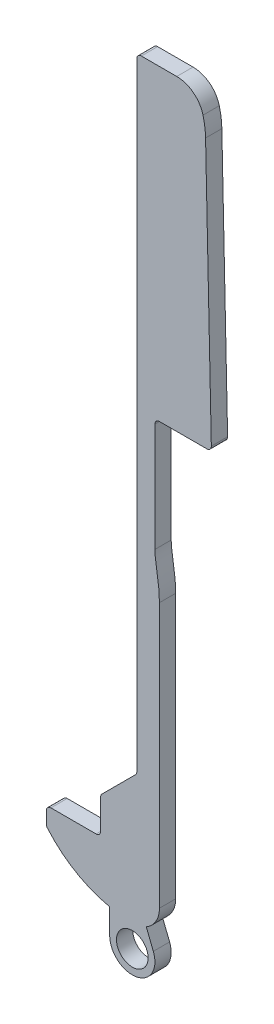
ISO-10303-21;
HEADER;
FILE_DESCRIPTION(('STEP AP214'),'2;1');
FILE_NAME('part.step','',(''),(''),'','','');
FILE_SCHEMA(('AUTOMOTIVE_DESIGN { 1 0 10303 214 1 1 1 1 }'));
ENDSEC;
DATA;
#1=APPLICATION_CONTEXT('core data for automotive mechanical design processes');
#2=APPLICATION_PROTOCOL_DEFINITION('international standard','automotive_design',2000,#1);
#3=PRODUCT_CONTEXT('',#1,'mechanical');
#4=PRODUCT('Part','Part','',(#3));
#5=PRODUCT_RELATED_PRODUCT_CATEGORY('part','',(#4));
#6=PRODUCT_DEFINITION_FORMATION('','',#4);
#7=PRODUCT_DEFINITION_CONTEXT('part definition',#1,'design');
#8=PRODUCT_DEFINITION('design','',#6,#7);
#9=PRODUCT_DEFINITION_SHAPE('','',#8);
#10=(LENGTH_UNIT() NAMED_UNIT(*) SI_UNIT(.MILLI.,.METRE.));
#11=(NAMED_UNIT(*) PLANE_ANGLE_UNIT() SI_UNIT($,.RADIAN.));
#12=(NAMED_UNIT(*) SI_UNIT($,.STERADIAN.) SOLID_ANGLE_UNIT());
#13=UNCERTAINTY_MEASURE_WITH_UNIT(LENGTH_MEASURE(1.E-05),#10,'distance_accuracy_value','');
#14=(GEOMETRIC_REPRESENTATION_CONTEXT(3) GLOBAL_UNCERTAINTY_ASSIGNED_CONTEXT((#13)) GLOBAL_UNIT_ASSIGNED_CONTEXT((#10,
#11,#12)) REPRESENTATION_CONTEXT('',''));
#15=CARTESIAN_POINT('',(0.,0.,0.));
#16=DIRECTION('',(0.,0.,1.));
#17=DIRECTION('',(1.,0.,0.));
#18=AXIS2_PLACEMENT_3D('',#15,#16,#17);
#19=CARTESIAN_POINT('',(14.4143233217841,80.5,1.8));
#20=DIRECTION('',(0.,0.,-1.));
#21=DIRECTION('',(-1.,0.,0.));
#22=AXIS2_PLACEMENT_3D('',#19,#20,#21);
#23=CYLINDRICAL_SURFACE('',#22,3.);
#24=DIRECTION('',(0.,0.,-1.));
#25=VECTOR('',#24,1.);
#26=CARTESIAN_POINT('',(17.3194338133368,81.2485539605604,1.8));
#27=LINE('',#26,#25);
#28=CARTESIAN_POINT('',(17.3194338133368,81.2485539605604,0.));
#29=VERTEX_POINT('',#28);
#30=CARTESIAN_POINT('',(17.3194338133368,81.2485539605604,1.8));
#31=VERTEX_POINT('',#30);
#32=EDGE_CURVE('E320',#29,#31,#27,.F.);
#33=ORIENTED_EDGE('',*,*,#32,.F.);
#34=CARTESIAN_POINT('',(14.4143233217841,80.5,0.));
#35=DIRECTION('',(0.,0.,-1.));
#36=DIRECTION('',(-1.,0.,0.));
#37=AXIS2_PLACEMENT_3D('',#34,#35,#36);
#38=CIRCLE('',#37,3.);
#39=CARTESIAN_POINT('',(14.4143233217841,83.5,0.));
#40=VERTEX_POINT('',#39);
#41=EDGE_CURVE('E45',#40,#29,#38,.T.);
#42=ORIENTED_EDGE('',*,*,#41,.F.);
#43=DIRECTION('',(0.,0.,-1.));
#44=VECTOR('',#43,1.);
#45=CARTESIAN_POINT('',(14.4143233217841,83.5,1.8));
#46=LINE('',#45,#44);
#47=CARTESIAN_POINT('',(14.4143233217841,83.5,1.8));
#48=VERTEX_POINT('',#47);
#49=EDGE_CURVE('E324',#48,#40,#46,.T.);
#50=ORIENTED_EDGE('',*,*,#49,.F.);
#51=CARTESIAN_POINT('',(14.4143233217841,80.5,1.8));
#52=DIRECTION('',(0.,0.,-1.));
#53=DIRECTION('',(-1.,0.,0.));
#54=AXIS2_PLACEMENT_3D('',#51,#52,#53);
#55=CIRCLE('',#54,3.);
#56=EDGE_CURVE('E11',#31,#48,#55,.F.);
#57=ORIENTED_EDGE('',*,*,#56,.F.);
#58=EDGE_LOOP('',(#33,#42,#50,#57));
#59=FACE_BOUND('',#58,.T.);
#60=ADVANCED_FACE('F38',(#59),#23,.T.);
#61=CARTESIAN_POINT('',(9.61,12.5113444444444,1.8));
#62=DIRECTION('',(0.,0.,-1.));
#63=DIRECTION('',(-1.,0.,0.));
#64=AXIS2_PLACEMENT_3D('',#61,#62,#63);
#65=CYLINDRICAL_SURFACE('',#64,12.5113444444444);
#66=DIRECTION('',(0.,0.,-1.));
#67=VECTOR('',#66,1.);
#68=CARTESIAN_POINT('',(7.,0.275265014842374,1.8));
#69=LINE('',#68,#67);
#70=CARTESIAN_POINT('',(7.,0.275265014842374,1.8));
#71=VERTEX_POINT('',#70);
#72=CARTESIAN_POINT('',(7.,0.275265014842374,0.));
#73=VERTEX_POINT('',#72);
#74=EDGE_CURVE('E232',#71,#73,#69,.T.);
#75=ORIENTED_EDGE('',*,*,#74,.F.);
#76=CARTESIAN_POINT('',(9.61,12.5113444444444,1.8));
#77=DIRECTION('',(0.,0.,1.));
#78=DIRECTION('',(-1.,0.,0.));
#79=AXIS2_PLACEMENT_3D('',#76,#77,#78);
#80=CIRCLE('',#79,12.5113444444444);
#81=CARTESIAN_POINT('',(0.120775174580328,4.35730544403674,1.8));
#82=VERTEX_POINT('',#81);
#83=EDGE_CURVE('E242',#82,#71,#80,.T.);
#84=ORIENTED_EDGE('',*,*,#83,.F.);
#85=DIRECTION('',(0.,0.,-1.));
#86=VECTOR('',#85,1.);
#87=CARTESIAN_POINT('',(0.120775174580328,4.35730544403674,1.8));
#88=LINE('',#87,#86);
#89=CARTESIAN_POINT('',(0.120775174580328,4.35730544403674,0.));
#90=VERTEX_POINT('',#89);
#91=EDGE_CURVE('E397',#82,#90,#88,.T.);
#92=ORIENTED_EDGE('',*,*,#91,.T.);
#93=CARTESIAN_POINT('',(9.61,12.5113444444444,0.));
#94=DIRECTION('',(0.,0.,1.));
#95=DIRECTION('',(-1.,0.,0.));
#96=AXIS2_PLACEMENT_3D('',#93,#94,#95);
#97=CIRCLE('',#96,12.5113444444444);
#98=EDGE_CURVE('E241',#90,#73,#97,.T.);
#99=ORIENTED_EDGE('',*,*,#98,.T.);
#100=EDGE_LOOP('',(#75,#84,#92,#99));
#101=FACE_BOUND('',#100,.T.);
#102=ADVANCED_FACE('F274',(#101),#65,.T.);
#103=CARTESIAN_POINT('',(9.61,2.89,1.8));
#104=DIRECTION('',(0.,0.,-1.));
#105=DIRECTION('',(-1.,0.,0.));
#106=AXIS2_PLACEMENT_3D('',#103,#104,#105);
#107=CYLINDRICAL_SURFACE('',#106,2.89000000000001);
#108=DIRECTION('',(0.,0.,-1.));
#109=VECTOR('',#108,1.);
#110=CARTESIAN_POINT('',(11.0467605424043,0.382447579054421,1.8));
#111=LINE('',#110,#109);
#112=CARTESIAN_POINT('',(11.0467605424043,0.382447579054422,0.));
#113=VERTEX_POINT('',#112);
#114=CARTESIAN_POINT('',(11.0467605424043,0.382447579054422,1.8));
#115=VERTEX_POINT('',#114);
#116=EDGE_CURVE('E215',#113,#115,#111,.F.);
#117=ORIENTED_EDGE('',*,*,#116,.F.);
#118=CARTESIAN_POINT('',(9.61,2.89,0.));
#119=DIRECTION('',(0.,0.,1.));
#120=DIRECTION('',(-1.,0.,0.));
#121=AXIS2_PLACEMENT_3D('',#118,#119,#120);
#122=CIRCLE('',#121,2.89000000000001);
#123=CARTESIAN_POINT('',(12.5,2.89,0.));
#124=VERTEX_POINT('',#123);
#125=EDGE_CURVE('E471',#113,#124,#122,.T.);
#126=ORIENTED_EDGE('',*,*,#125,.T.);
#127=DIRECTION('',(0.,0.,-1.));
#128=VECTOR('',#127,1.);
#129=CARTESIAN_POINT('',(12.5,2.89,1.8));
#130=LINE('',#129,#128);
#131=CARTESIAN_POINT('',(12.5,2.89,1.8));
#132=VERTEX_POINT('',#131);
#133=EDGE_CURVE('E365',#132,#124,#130,.T.);
#134=ORIENTED_EDGE('',*,*,#133,.F.);
#135=CARTESIAN_POINT('',(9.61,2.89,1.8));
#136=DIRECTION('',(0.,0.,1.));
#137=DIRECTION('',(-1.,0.,0.));
#138=AXIS2_PLACEMENT_3D('',#135,#136,#137);
#139=CIRCLE('',#138,2.89000000000001);
#140=EDGE_CURVE('E244',#115,#132,#139,.T.);
#141=ORIENTED_EDGE('',*,*,#140,.F.);
#142=EDGE_LOOP('',(#117,#126,#134,#141));
#143=FACE_BOUND('',#142,.T.);
#144=ADVANCED_FACE('F270',(#143),#107,.T.);
#145=CARTESIAN_POINT('',(12.5,32.15,1.8));
#146=DIRECTION('',(-1.,0.,0.));
#147=DIRECTION('',(0.,-1.,0.));
#148=AXIS2_PLACEMENT_3D('',#145,#146,#147);
#149=PLANE('',#148);
#150=DIRECTION('',(0.,1.,0.));
#151=VECTOR('',#150,1.);
#152=CARTESIAN_POINT('',(12.5,32.15,0.));
#153=LINE('',#152,#151);
#154=CARTESIAN_POINT('',(12.5,32.15,0.));
#155=VERTEX_POINT('',#154);
#156=EDGE_CURVE('E473',#124,#155,#153,.T.);
#157=ORIENTED_EDGE('',*,*,#156,.T.);
#158=DIRECTION('',(0.,0.,-1.));
#159=VECTOR('',#158,1.);
#160=CARTESIAN_POINT('',(12.5,32.15,1.8));
#161=LINE('',#160,#159);
#162=CARTESIAN_POINT('',(12.5,32.15,1.8));
#163=VERTEX_POINT('',#162);
#164=EDGE_CURVE('E362',#163,#155,#161,.T.);
#165=ORIENTED_EDGE('',*,*,#164,.F.);
#166=DIRECTION('',(0.,1.,0.));
#167=VECTOR('',#166,1.);
#168=CARTESIAN_POINT('',(12.5,32.15,1.8));
#169=LINE('',#168,#167);
#170=EDGE_CURVE('E247',#132,#163,#169,.T.);
#171=ORIENTED_EDGE('',*,*,#170,.F.);
#172=ORIENTED_EDGE('',*,*,#133,.T.);
#173=EDGE_LOOP('',(#157,#165,#171,#172));
#174=FACE_BOUND('',#173,.T.);
#175=ADVANCED_FACE('F265',(#174),#149,.F.);
#176=CARTESIAN_POINT('',(12.5,32.15,1.8));
#177=CARTESIAN_POINT('',(12.5,34.1534508074309,1.8));
#178=CARTESIAN_POINT('',(12.,35.7421929324208,1.8));
#179=CARTESIAN_POINT('',(12.,37.,1.8));
#180=B_SPLINE_CURVE_WITH_KNOTS('',3,(#176,#177,#178,#179),.UNSPECIFIED.,.F.,.F.,(4,4),(0.,1.),.UNSPECIFIED.);
#181=DIRECTION('',(0.,0.,-1.));
#182=VECTOR('',#181,1.);
#183=SURFACE_OF_LINEAR_EXTRUSION('',#180,#182);
#184=CARTESIAN_POINT('',(12.5,32.15,0.));
#185=CARTESIAN_POINT('',(12.5,34.1534508074309,0.));
#186=CARTESIAN_POINT('',(12.,35.7421929324208,0.));
#187=CARTESIAN_POINT('',(12.,37.,0.));
#188=B_SPLINE_CURVE_WITH_KNOTS('',3,(#184,#185,#186,#187),.UNSPECIFIED.,.F.,.F.,(4,4),(0.,1.),.UNSPECIFIED.);
#189=CARTESIAN_POINT('',(12.,37.,0.));
#190=VERTEX_POINT('',#189);
#191=EDGE_CURVE('E475',#155,#190,#188,.T.);
#192=ORIENTED_EDGE('',*,*,#191,.T.);
#193=DIRECTION('',(0.,0.,-1.));
#194=VECTOR('',#193,1.);
#195=CARTESIAN_POINT('',(12.,37.,1.8));
#196=LINE('',#195,#194);
#197=CARTESIAN_POINT('',(12.,37.,1.8));
#198=VERTEX_POINT('',#197);
#199=EDGE_CURVE('E358',#198,#190,#196,.T.);
#200=ORIENTED_EDGE('',*,*,#199,.F.);
#201=EDGE_CURVE('E249',#163,#198,#180,.T.);
#202=ORIENTED_EDGE('',*,*,#201,.F.);
#203=ORIENTED_EDGE('',*,*,#164,.T.);
#204=EDGE_LOOP('',(#192,#200,#202,#203));
#205=FACE_BOUND('',#204,.T.);
#206=ADVANCED_FACE('F260',(#205),#183,.F.);
#207=CARTESIAN_POINT('',(12.,49.5,1.8));
#208=DIRECTION('',(-1.,0.,0.));
#209=DIRECTION('',(0.,-1.,0.));
#210=AXIS2_PLACEMENT_3D('',#207,#208,#209);
#211=PLANE('',#210);
#212=DIRECTION('',(0.,1.,0.));
#213=VECTOR('',#212,1.);
#214=CARTESIAN_POINT('',(12.,49.5,0.));
#215=LINE('',#214,#213);
#216=CARTESIAN_POINT('',(12.,49.,0.));
#217=VERTEX_POINT('',#216);
#218=EDGE_CURVE('E479',#190,#217,#215,.T.);
#219=ORIENTED_EDGE('',*,*,#218,.T.);
#220=DIRECTION('',(0.,0.,-1.));
#221=VECTOR('',#220,1.);
#222=CARTESIAN_POINT('',(12.,49.,1.8));
#223=LINE('',#222,#221);
#224=CARTESIAN_POINT('',(12.,49.,1.8));
#225=VERTEX_POINT('',#224);
#226=EDGE_CURVE('E425',#217,#225,#223,.F.);
#227=ORIENTED_EDGE('',*,*,#226,.T.);
#228=DIRECTION('',(0.,1.,0.));
#229=VECTOR('',#228,1.);
#230=CARTESIAN_POINT('',(12.,49.5,1.8));
#231=LINE('',#230,#229);
#232=EDGE_CURVE('E254',#198,#225,#231,.T.);
#233=ORIENTED_EDGE('',*,*,#232,.F.);
#234=ORIENTED_EDGE('',*,*,#199,.T.);
#235=EDGE_LOOP('',(#219,#227,#233,#234));
#236=FACE_BOUND('',#235,.T.);
#237=ADVANCED_FACE('F264',(#236),#211,.F.);
#238=CARTESIAN_POINT('',(18.25,49.5,1.8));
#239=DIRECTION('',(0.,1.,0.));
#240=DIRECTION('',(0.,0.,1.));
#241=AXIS2_PLACEMENT_3D('',#238,#239,#240);
#242=PLANE('',#241);
#243=DIRECTION('',(1.,0.,0.));
#244=VECTOR('',#243,1.);
#245=CARTESIAN_POINT('',(18.25,49.5,1.8));
#246=LINE('',#245,#244);
#247=CARTESIAN_POINT('',(12.5,49.5,1.8));
#248=VERTEX_POINT('',#247);
#249=CARTESIAN_POINT('',(17.7389709464066,49.5,1.8));
#250=VERTEX_POINT('',#249);
#251=EDGE_CURVE('E494',#248,#250,#246,.T.);
#252=ORIENTED_EDGE('',*,*,#251,.F.);
#253=DIRECTION('',(0.,0.,-1.));
#254=VECTOR('',#253,1.);
#255=CARTESIAN_POINT('',(12.5,49.5,0.));
#256=LINE('',#255,#254);
#257=CARTESIAN_POINT('',(12.5,49.5,0.));
#258=VERTEX_POINT('',#257);
#259=EDGE_CURVE('E422',#248,#258,#256,.T.);
#260=ORIENTED_EDGE('',*,*,#259,.T.);
#261=DIRECTION('',(1.,0.,0.));
#262=VECTOR('',#261,1.);
#263=CARTESIAN_POINT('',(18.25,49.5,0.));
#264=LINE('',#263,#262);
#265=CARTESIAN_POINT('',(17.7389709464066,49.5,0.));
#266=VERTEX_POINT('',#265);
#267=EDGE_CURVE('E340',#258,#266,#264,.T.);
#268=ORIENTED_EDGE('',*,*,#267,.T.);
#269=DIRECTION('',(0.,0.,-1.));
#270=VECTOR('',#269,1.);
#271=CARTESIAN_POINT('',(17.7389709464066,49.5,1.8));
#272=LINE('',#271,#270);
#273=EDGE_CURVE('E420',#266,#250,#272,.F.);
#274=ORIENTED_EDGE('',*,*,#273,.T.);
#275=EDGE_LOOP('',(#252,#260,#268,#274));
#276=FACE_BOUND('',#275,.T.);
#277=ADVANCED_FACE('F489',(#276),#242,.F.);
#278=CARTESIAN_POINT('',(18.25,49.5,1.8));
#279=DIRECTION('',(-0.999762027079909,-0.0218148850345616,0.));
#280=DIRECTION('',(0.0218148850345616,-0.999762027079909,0.));
#281=AXIS2_PLACEMENT_3D('',#278,#279,#280);
#282=PLANE('',#281);
#283=DIRECTION('',(-0.0218148850345616,0.999762027079909,0.));
#284=VECTOR('',#283,1.);
#285=CARTESIAN_POINT('',(18.25,49.5,1.8));
#286=LINE('',#285,#284);
#287=CARTESIAN_POINT('',(18.2388519599465,50.0109074425173,1.8));
#288=VERTEX_POINT('',#287);
#289=CARTESIAN_POINT('',(17.601960582398,79.1992260441903,1.8));
#290=VERTEX_POINT('',#289);
#291=EDGE_CURVE('E456',#288,#290,#286,.T.);
#292=ORIENTED_EDGE('',*,*,#291,.F.);
#293=DIRECTION('',(0.,0.,-1.));
#294=VECTOR('',#293,1.);
#295=CARTESIAN_POINT('',(18.2388519599465,50.0109074425173,1.8));
#296=LINE('',#295,#294);
#297=CARTESIAN_POINT('',(18.2388519599465,50.0109074425173,0.));
#298=VERTEX_POINT('',#297);
#299=EDGE_CURVE('E427',#288,#298,#296,.T.);
#300=ORIENTED_EDGE('',*,*,#299,.T.);
#301=DIRECTION('',(-0.0218148850345616,0.999762027079909,0.));
#302=VECTOR('',#301,1.);
#303=CARTESIAN_POINT('',(18.25,49.5,0.));
#304=LINE('',#303,#302);
#305=CARTESIAN_POINT('',(17.601960582398,79.1992260441903,0.));
#306=VERTEX_POINT('',#305);
#307=EDGE_CURVE('E336',#298,#306,#304,.T.);
#308=ORIENTED_EDGE('',*,*,#307,.T.);
#309=DIRECTION('',(0.,0.,-1.));
#310=VECTOR('',#309,1.);
#311=CARTESIAN_POINT('',(17.601960582398,79.1992260441903,1.8));
#312=LINE('',#311,#310);
#313=EDGE_CURVE('E332',#290,#306,#312,.T.);
#314=ORIENTED_EDGE('',*,*,#313,.F.);
#315=EDGE_LOOP('',(#292,#300,#308,#314));
#316=FACE_BOUND('',#315,.T.);
#317=ADVANCED_FACE('F496',(#316),#282,.F.);
#318=CARTESIAN_POINT('',(8.60410233867879,79.0028920788793,1.8));
#319=DIRECTION('',(0.,0.,-1.));
#320=DIRECTION('',(-1.,0.,0.));
#321=AXIS2_PLACEMENT_3D('',#318,#319,#320);
#322=CYLINDRICAL_SURFACE('',#321,9.00000000000001);
#323=CARTESIAN_POINT('',(8.60410233867879,79.0028920788793,0.));
#324=DIRECTION('',(0.,0.,1.));
#325=DIRECTION('',(1.,0.,0.));
#326=AXIS2_PLACEMENT_3D('',#323,#324,#325);
#327=CIRCLE('',#326,9.00000000000001);
#328=EDGE_CURVE('E329',#306,#29,#327,.T.);
#329=ORIENTED_EDGE('',*,*,#328,.T.);
#330=ORIENTED_EDGE('',*,*,#32,.T.);
#331=CARTESIAN_POINT('',(8.60410233867879,79.0028920788793,1.8));
#332=DIRECTION('',(0.,0.,1.));
#333=DIRECTION('',(1.,0.,0.));
#334=AXIS2_PLACEMENT_3D('',#331,#332,#333);
#335=CIRCLE('',#334,9.00000000000001);
#336=EDGE_CURVE('E451',#290,#31,#335,.T.);
#337=ORIENTED_EDGE('',*,*,#336,.F.);
#338=ORIENTED_EDGE('',*,*,#313,.T.);
#339=EDGE_LOOP('',(#329,#330,#337,#338));
#340=FACE_BOUND('',#339,.T.);
#341=ADVANCED_FACE('F330',(#340),#322,.T.);
#342=CARTESIAN_POINT('',(10.,83.5,1.8));
#343=DIRECTION('',(0.,-1.,0.));
#344=DIRECTION('',(0.,0.,-1.));
#345=AXIS2_PLACEMENT_3D('',#342,#343,#344);
#346=PLANE('',#345);
#347=DIRECTION('',(-1.,0.,0.));
#348=VECTOR('',#347,1.);
#349=CARTESIAN_POINT('',(10.,83.5,1.8));
#350=LINE('',#349,#348);
#351=CARTESIAN_POINT('',(10.5,83.5,1.8));
#352=VERTEX_POINT('',#351);
#353=EDGE_CURVE('E449',#48,#352,#350,.T.);
#354=ORIENTED_EDGE('',*,*,#353,.F.);
#355=ORIENTED_EDGE('',*,*,#49,.T.);
#356=DIRECTION('',(-1.,0.,0.));
#357=VECTOR('',#356,1.);
#358=CARTESIAN_POINT('',(10.,83.5,0.));
#359=LINE('',#358,#357);
#360=CARTESIAN_POINT('',(10.5,83.5,0.));
#361=VERTEX_POINT('',#360);
#362=EDGE_CURVE('E335',#40,#361,#359,.T.);
#363=ORIENTED_EDGE('',*,*,#362,.T.);
#364=DIRECTION('',(0.,0.,-1.));
#365=VECTOR('',#364,1.);
#366=CARTESIAN_POINT('',(10.5,83.5,1.8));
#367=LINE('',#366,#365);
#368=EDGE_CURVE('E384',#361,#352,#367,.F.);
#369=ORIENTED_EDGE('',*,*,#368,.T.);
#370=EDGE_LOOP('',(#354,#355,#363,#369));
#371=FACE_BOUND('',#370,.T.);
#372=ADVANCED_FACE('F447',(#371),#346,.F.);
#373=CARTESIAN_POINT('',(10.,14.5,1.8));
#374=DIRECTION('',(1.,0.,0.));
#375=DIRECTION('',(0.,0.,-1.));
#376=AXIS2_PLACEMENT_3D('',#373,#374,#375);
#377=PLANE('',#376);
#378=DIRECTION('',(0.,-1.,0.));
#379=VECTOR('',#378,1.);
#380=CARTESIAN_POINT('',(10.,14.5,1.8));
#381=LINE('',#380,#379);
#382=CARTESIAN_POINT('',(10.,83.,1.8));
#383=VERTEX_POINT('',#382);
#384=CARTESIAN_POINT('',(10.,14.7071067811865,1.8));
#385=VERTEX_POINT('',#384);
#386=EDGE_CURVE('E450',#383,#385,#381,.T.);
#387=ORIENTED_EDGE('',*,*,#386,.F.);
#388=DIRECTION('',(0.,0.,-1.));
#389=VECTOR('',#388,1.);
#390=CARTESIAN_POINT('',(10.,83.,1.8));
#391=LINE('',#390,#389);
#392=CARTESIAN_POINT('',(10.,83.,0.));
#393=VERTEX_POINT('',#392);
#394=EDGE_CURVE('E370',#383,#393,#391,.T.);
#395=ORIENTED_EDGE('',*,*,#394,.T.);
#396=DIRECTION('',(0.,-1.,0.));
#397=VECTOR('',#396,1.);
#398=CARTESIAN_POINT('',(10.,14.5,0.));
#399=LINE('',#398,#397);
#400=CARTESIAN_POINT('',(10.,14.7071067811865,0.));
#401=VERTEX_POINT('',#400);
#402=EDGE_CURVE('E338',#393,#401,#399,.T.);
#403=ORIENTED_EDGE('',*,*,#402,.T.);
#404=DIRECTION('',(0.,0.,-1.));
#405=VECTOR('',#404,1.);
#406=CARTESIAN_POINT('',(10.,14.7071067811865,1.8));
#407=LINE('',#406,#405);
#408=EDGE_CURVE('E368',#401,#385,#407,.F.);
#409=ORIENTED_EDGE('',*,*,#408,.T.);
#410=EDGE_LOOP('',(#387,#395,#403,#409));
#411=FACE_BOUND('',#410,.T.);
#412=ADVANCED_FACE('F548',(#411),#377,.F.);
#413=CARTESIAN_POINT('',(6.,10.5,1.8));
#414=DIRECTION('',(0.707106781186546,-0.707106781186549,0.));
#415=DIRECTION('',(0.707106781186549,0.707106781186546,0.));
#416=AXIS2_PLACEMENT_3D('',#413,#414,#415);
#417=PLANE('',#416);
#418=DIRECTION('',(-0.707106781186549,-0.707106781186546,0.));
#419=VECTOR('',#418,1.);
#420=CARTESIAN_POINT('',(6.,10.5,1.8));
#421=LINE('',#420,#419);
#422=CARTESIAN_POINT('',(9.85355339059327,14.3535533905933,1.8));
#423=VERTEX_POINT('',#422);
#424=CARTESIAN_POINT('',(6.14644660940673,10.6464466094067,1.8));
#425=VERTEX_POINT('',#424);
#426=EDGE_CURVE('E454',#423,#425,#421,.T.);
#427=ORIENTED_EDGE('',*,*,#426,.F.);
#428=DIRECTION('',(0.,0.,-1.));
#429=VECTOR('',#428,1.);
#430=CARTESIAN_POINT('',(9.85355339059327,14.3535533905933,0.));
#431=LINE('',#430,#429);
#432=CARTESIAN_POINT('',(9.85355339059327,14.3535533905933,0.));
#433=VERTEX_POINT('',#432);
#434=EDGE_CURVE('E417',#423,#433,#431,.T.);
#435=ORIENTED_EDGE('',*,*,#434,.T.);
#436=DIRECTION('',(-0.707106781186549,-0.707106781186546,0.));
#437=VECTOR('',#436,1.);
#438=CARTESIAN_POINT('',(6.,10.5,0.));
#439=LINE('',#438,#437);
#440=CARTESIAN_POINT('',(6.14644660940673,10.6464466094067,0.));
#441=VERTEX_POINT('',#440);
#442=EDGE_CURVE('E346',#433,#441,#439,.T.);
#443=ORIENTED_EDGE('',*,*,#442,.T.);
#444=DIRECTION('',(0.,0.,-1.));
#445=VECTOR('',#444,1.);
#446=CARTESIAN_POINT('',(6.14644660940673,10.6464466094067,1.8));
#447=LINE('',#446,#445);
#448=EDGE_CURVE('E415',#441,#425,#447,.F.);
#449=ORIENTED_EDGE('',*,*,#448,.T.);
#450=EDGE_LOOP('',(#427,#435,#443,#449));
#451=FACE_BOUND('',#450,.T.);
#452=ADVANCED_FACE('F544',(#451),#417,.F.);
#453=CARTESIAN_POINT('',(6.,6.5,1.8));
#454=DIRECTION('',(1.,0.,0.));
#455=DIRECTION('',(0.,0.,-1.));
#456=AXIS2_PLACEMENT_3D('',#453,#454,#455);
#457=PLANE('',#456);
#458=DIRECTION('',(0.,-1.,0.));
#459=VECTOR('',#458,1.);
#460=CARTESIAN_POINT('',(6.,6.5,0.));
#461=LINE('',#460,#459);
#462=CARTESIAN_POINT('',(6.,10.2928932188135,0.));
#463=VERTEX_POINT('',#462);
#464=CARTESIAN_POINT('',(6.,7.,0.));
#465=VERTEX_POINT('',#464);
#466=EDGE_CURVE('E349',#463,#465,#461,.T.);
#467=ORIENTED_EDGE('',*,*,#466,.T.);
#468=DIRECTION('',(0.,0.,-1.));
#469=VECTOR('',#468,1.);
#470=CARTESIAN_POINT('',(6.,7.,1.8));
#471=LINE('',#470,#469);
#472=CARTESIAN_POINT('',(6.,7.,1.8));
#473=VERTEX_POINT('',#472);
#474=EDGE_CURVE('E413',#465,#473,#471,.F.);
#475=ORIENTED_EDGE('',*,*,#474,.T.);
#476=DIRECTION('',(0.,-1.,0.));
#477=VECTOR('',#476,1.);
#478=CARTESIAN_POINT('',(6.,6.5,1.8));
#479=LINE('',#478,#477);
#480=CARTESIAN_POINT('',(6.,10.2928932188135,1.8));
#481=VERTEX_POINT('',#480);
#482=EDGE_CURVE('E462',#481,#473,#479,.T.);
#483=ORIENTED_EDGE('',*,*,#482,.F.);
#484=DIRECTION('',(0.,0.,-1.));
#485=VECTOR('',#484,1.);
#486=CARTESIAN_POINT('',(6.,10.2928932188135,1.8));
#487=LINE('',#486,#485);
#488=EDGE_CURVE('E410',#481,#463,#487,.T.);
#489=ORIENTED_EDGE('',*,*,#488,.T.);
#490=EDGE_LOOP('',(#467,#475,#483,#489));
#491=FACE_BOUND('',#490,.T.);
#492=ADVANCED_FACE('F540',(#491),#457,.F.);
#493=CARTESIAN_POINT('',(0.,6.5,1.8));
#494=DIRECTION('',(0.,-1.,0.));
#495=DIRECTION('',(0.,0.,-1.));
#496=AXIS2_PLACEMENT_3D('',#493,#494,#495);
#497=PLANE('',#496);
#498=DIRECTION('',(-1.,0.,0.));
#499=VECTOR('',#498,1.);
#500=CARTESIAN_POINT('',(0.,6.5,0.));
#501=LINE('',#500,#499);
#502=CARTESIAN_POINT('',(5.5,6.5,0.));
#503=VERTEX_POINT('',#502);
#504=CARTESIAN_POINT('',(0.5,6.5,0.));
#505=VERTEX_POINT('',#504);
#506=EDGE_CURVE('E352',#503,#505,#501,.T.);
#507=ORIENTED_EDGE('',*,*,#506,.T.);
#508=DIRECTION('',(0.,0.,-1.));
#509=VECTOR('',#508,1.);
#510=CARTESIAN_POINT('',(0.5,6.5,1.8));
#511=LINE('',#510,#509);
#512=CARTESIAN_POINT('',(0.5,6.5,1.8));
#513=VERTEX_POINT('',#512);
#514=EDGE_CURVE('E408',#505,#513,#511,.F.);
#515=ORIENTED_EDGE('',*,*,#514,.T.);
#516=DIRECTION('',(-1.,0.,0.));
#517=VECTOR('',#516,1.);
#518=CARTESIAN_POINT('',(0.,6.5,1.8));
#519=LINE('',#518,#517);
#520=CARTESIAN_POINT('',(5.5,6.5,1.8));
#521=VERTEX_POINT('',#520);
#522=EDGE_CURVE('E465',#521,#513,#519,.T.);
#523=ORIENTED_EDGE('',*,*,#522,.F.);
#524=DIRECTION('',(0.,0.,-1.));
#525=VECTOR('',#524,1.);
#526=CARTESIAN_POINT('',(5.5,6.5,0.));
#527=LINE('',#526,#525);
#528=EDGE_CURVE('E405',#521,#503,#527,.T.);
#529=ORIENTED_EDGE('',*,*,#528,.T.);
#530=EDGE_LOOP('',(#507,#515,#523,#529));
#531=FACE_BOUND('',#530,.T.);
#532=ADVANCED_FACE('F533',(#531),#497,.F.);
#533=CARTESIAN_POINT('',(0.,4.5,1.8));
#534=DIRECTION('',(1.,0.,0.));
#535=DIRECTION('',(0.,0.,-1.));
#536=AXIS2_PLACEMENT_3D('',#533,#534,#535);
#537=PLANE('',#536);
#538=DIRECTION('',(0.,-1.,0.));
#539=VECTOR('',#538,1.);
#540=CARTESIAN_POINT('',(0.,4.5,0.));
#541=LINE('',#540,#539);
#542=CARTESIAN_POINT('',(0.,6.,0.));
#543=VERTEX_POINT('',#542);
#544=CARTESIAN_POINT('',(0.,4.68317126271894,0.));
#545=VERTEX_POINT('',#544);
#546=EDGE_CURVE('E245',#543,#545,#541,.T.);
#547=ORIENTED_EDGE('',*,*,#546,.T.);
#548=DIRECTION('',(0.,0.,-1.));
#549=VECTOR('',#548,1.);
#550=CARTESIAN_POINT('',(0.,4.68317126271894,1.8));
#551=LINE('',#550,#549);
#552=CARTESIAN_POINT('',(0.,4.68317126271894,1.8));
#553=VERTEX_POINT('',#552);
#554=EDGE_CURVE('E403',#545,#553,#551,.F.);
#555=ORIENTED_EDGE('',*,*,#554,.T.);
#556=DIRECTION('',(0.,-1.,0.));
#557=VECTOR('',#556,1.);
#558=CARTESIAN_POINT('',(0.,4.5,1.8));
#559=LINE('',#558,#557);
#560=CARTESIAN_POINT('',(0.,6.,1.8));
#561=VERTEX_POINT('',#560);
#562=EDGE_CURVE('E359',#561,#553,#559,.T.);
#563=ORIENTED_EDGE('',*,*,#562,.F.);
#564=DIRECTION('',(0.,0.,-1.));
#565=VECTOR('',#564,1.);
#566=CARTESIAN_POINT('',(0.,6.,1.8));
#567=LINE('',#566,#565);
#568=EDGE_CURVE('E400',#561,#543,#567,.T.);
#569=ORIENTED_EDGE('',*,*,#568,.T.);
#570=EDGE_LOOP('',(#547,#555,#563,#569));
#571=FACE_BOUND('',#570,.T.);
#572=ADVANCED_FACE('F526',(#571),#537,.F.);
#573=CARTESIAN_POINT('',(9.61,12.5113444444444,1.8));
#574=DIRECTION('',(0.,0.,-1.));
#575=DIRECTION('',(-1.,0.,0.));
#576=AXIS2_PLACEMENT_3D('',#573,#574,#575);
#577=PLANE('',#576);
#578=ORIENTED_EDGE('',*,*,#336,.T.);
#579=ORIENTED_EDGE('',*,*,#56,.T.);
#580=ORIENTED_EDGE('',*,*,#353,.T.);
#581=CARTESIAN_POINT('',(10.5,83.,1.8));
#582=DIRECTION('',(0.,0.,-1.));
#583=DIRECTION('',(-1.,0.,0.));
#584=AXIS2_PLACEMENT_3D('',#581,#582,#583);
#585=CIRCLE('',#584,0.5);
#586=EDGE_CURVE('E395',#352,#383,#585,.F.);
#587=ORIENTED_EDGE('',*,*,#586,.T.);
#588=ORIENTED_EDGE('',*,*,#386,.T.);
#589=CARTESIAN_POINT('',(9.5,14.7071067811865,1.8));
#590=DIRECTION('',(0.,0.,-1.));
#591=DIRECTION('',(-1.,0.,0.));
#592=AXIS2_PLACEMENT_3D('',#589,#590,#591);
#593=CIRCLE('',#592,0.5);
#594=EDGE_CURVE('E436',#385,#423,#593,.T.);
#595=ORIENTED_EDGE('',*,*,#594,.T.);
#596=ORIENTED_EDGE('',*,*,#426,.T.);
#597=CARTESIAN_POINT('',(6.5,10.2928932188135,1.8));
#598=DIRECTION('',(0.,0.,-1.));
#599=DIRECTION('',(-1.,0.,0.));
#600=AXIS2_PLACEMENT_3D('',#597,#598,#599);
#601=CIRCLE('',#600,0.5);
#602=EDGE_CURVE('E389',#425,#481,#601,.F.);
#603=ORIENTED_EDGE('',*,*,#602,.T.);
#604=ORIENTED_EDGE('',*,*,#482,.T.);
#605=CARTESIAN_POINT('',(5.5,7.,1.8));
#606=DIRECTION('',(0.,0.,-1.));
#607=DIRECTION('',(-1.,0.,0.));
#608=AXIS2_PLACEMENT_3D('',#605,#606,#607);
#609=CIRCLE('',#608,0.5);
#610=EDGE_CURVE('E432',#473,#521,#609,.T.);
#611=ORIENTED_EDGE('',*,*,#610,.T.);
#612=ORIENTED_EDGE('',*,*,#522,.T.);
#613=CARTESIAN_POINT('',(0.5,6.,1.8));
#614=DIRECTION('',(0.,0.,-1.));
#615=DIRECTION('',(-1.,0.,0.));
#616=AXIS2_PLACEMENT_3D('',#613,#614,#615);
#617=CIRCLE('',#616,0.5);
#618=EDGE_CURVE('E391',#513,#561,#617,.F.);
#619=ORIENTED_EDGE('',*,*,#618,.T.);
#620=ORIENTED_EDGE('',*,*,#562,.T.);
#621=CARTESIAN_POINT('',(0.5,4.68317126271894,1.8));
#622=DIRECTION('',(0.,0.,-1.));
#623=DIRECTION('',(-1.,0.,0.));
#624=AXIS2_PLACEMENT_3D('',#621,#622,#623);
#625=CIRCLE('',#624,0.5);
#626=EDGE_CURVE('E393',#553,#82,#625,.F.);
#627=ORIENTED_EDGE('',*,*,#626,.T.);
#628=ORIENTED_EDGE('',*,*,#83,.T.);
#629=DIRECTION('',(0.,-1.,0.));
#630=VECTOR('',#629,1.);
#631=CARTESIAN_POINT('',(7.00000000000001,-2.4995969660652,1.8));
#632=LINE('',#631,#630);
#633=CARTESIAN_POINT('',(7.00000000000001,-2.4995969660652,1.8));
#634=VERTEX_POINT('',#633);
#635=EDGE_CURVE('E216',#71,#634,#632,.T.);
#636=ORIENTED_EDGE('',*,*,#635,.T.);
#637=CARTESIAN_POINT('',(9.50000000000001,-2.4995969660652,1.8));
#638=DIRECTION('',(0.,0.,1.));
#639=DIRECTION('',(1.,0.,0.));
#640=AXIS2_PLACEMENT_3D('',#637,#638,#639);
#641=CIRCLE('',#640,2.5);
#642=CARTESIAN_POINT('',(11.8240453183332,-1.57828629189846,1.8));
#643=VERTEX_POINT('',#642);
#644=EDGE_CURVE('E217',#634,#643,#641,.T.);
#645=ORIENTED_EDGE('',*,*,#644,.T.);
#646=DIRECTION('',(-0.368524269666697,0.929618127333277,0.));
#647=VECTOR('',#646,1.);
#648=CARTESIAN_POINT('',(11.,0.500403033934804,1.8));
#649=LINE('',#648,#647);
#650=EDGE_CURVE('E208',#643,#115,#649,.T.);
#651=ORIENTED_EDGE('',*,*,#650,.T.);
#652=ORIENTED_EDGE('',*,*,#140,.T.);
#653=ORIENTED_EDGE('',*,*,#170,.T.);
#654=ORIENTED_EDGE('',*,*,#201,.T.);
#655=ORIENTED_EDGE('',*,*,#232,.T.);
#656=CARTESIAN_POINT('',(12.5,49.,1.8));
#657=DIRECTION('',(0.,0.,-1.));
#658=DIRECTION('',(-1.,0.,0.));
#659=AXIS2_PLACEMENT_3D('',#656,#657,#658);
#660=CIRCLE('',#659,0.5);
#661=EDGE_CURVE('E325',#225,#248,#660,.T.);
#662=ORIENTED_EDGE('',*,*,#661,.T.);
#663=ORIENTED_EDGE('',*,*,#251,.T.);
#664=CARTESIAN_POINT('',(17.7389709464066,50.,1.8));
#665=DIRECTION('',(0.,0.,-1.));
#666=DIRECTION('',(-1.,0.,0.));
#667=AXIS2_PLACEMENT_3D('',#664,#665,#666);
#668=CIRCLE('',#667,0.5);
#669=EDGE_CURVE('E387',#250,#288,#668,.F.);
#670=ORIENTED_EDGE('',*,*,#669,.T.);
#671=ORIENTED_EDGE('',*,*,#291,.T.);
#672=EDGE_LOOP('',(#578,#579,#580,#587,#588,#595,#596,#603,#604,#611,#612,#619,#620,#627,#628,
#636,#645,#651,#652,#653,#654,#655,#662,#663,#670,#671));
#673=FACE_BOUND('',#672,.T.);
#674=CARTESIAN_POINT('',(9.50000000000001,-2.4995969660652,1.8));
#675=DIRECTION('',(0.,0.,1.));
#676=DIRECTION('',(1.,0.,0.));
#677=AXIS2_PLACEMENT_3D('',#674,#675,#676);
#678=CIRCLE('',#677,1.75);
#679=CARTESIAN_POINT('',(11.25,-2.4995969660652,1.8));
#680=VERTEX_POINT('',#679);
#681=EDGE_CURVE('E513',#680,#680,#678,.T.);
#682=ORIENTED_EDGE('',*,*,#681,.F.);
#683=EDGE_LOOP('',(#682));
#684=FACE_BOUND('',#683,.T.);
#685=ADVANCED_FACE('F220',(#673,#684),#577,.F.);
#686=CARTESIAN_POINT('',(9.61,12.5113444444444,0.));
#687=DIRECTION('',(0.,0.,-1.));
#688=DIRECTION('',(-1.,0.,0.));
#689=AXIS2_PLACEMENT_3D('',#686,#687,#688);
#690=PLANE('',#689);
#691=ORIENTED_EDGE('',*,*,#362,.F.);
#692=ORIENTED_EDGE('',*,*,#41,.T.);
#693=ORIENTED_EDGE('',*,*,#328,.F.);
#694=ORIENTED_EDGE('',*,*,#307,.F.);
#695=CARTESIAN_POINT('',(17.7389709464066,50.,0.));
#696=DIRECTION('',(0.,0.,-1.));
#697=DIRECTION('',(-1.,0.,0.));
#698=AXIS2_PLACEMENT_3D('',#695,#696,#697);
#699=CIRCLE('',#698,0.5);
#700=EDGE_CURVE('E373',#298,#266,#699,.T.);
#701=ORIENTED_EDGE('',*,*,#700,.T.);
#702=ORIENTED_EDGE('',*,*,#267,.F.);
#703=CARTESIAN_POINT('',(12.5,49.,0.));
#704=DIRECTION('',(0.,0.,-1.));
#705=DIRECTION('',(-1.,0.,0.));
#706=AXIS2_PLACEMENT_3D('',#703,#704,#705);
#707=CIRCLE('',#706,0.5);
#708=EDGE_CURVE('E438',#258,#217,#707,.F.);
#709=ORIENTED_EDGE('',*,*,#708,.T.);
#710=ORIENTED_EDGE('',*,*,#218,.F.);
#711=ORIENTED_EDGE('',*,*,#191,.F.);
#712=ORIENTED_EDGE('',*,*,#156,.F.);
#713=ORIENTED_EDGE('',*,*,#125,.F.);
#714=DIRECTION('',(-0.368524269666697,0.929618127333277,0.));
#715=VECTOR('',#714,1.);
#716=CARTESIAN_POINT('',(11.,0.500403033934804,0.));
#717=LINE('',#716,#715);
#718=CARTESIAN_POINT('',(11.8240453183332,-1.57828629189846,0.));
#719=VERTEX_POINT('',#718);
#720=EDGE_CURVE('E511',#719,#113,#717,.T.);
#721=ORIENTED_EDGE('',*,*,#720,.F.);
#722=CARTESIAN_POINT('',(9.50000000000001,-2.4995969660652,0.));
#723=DIRECTION('',(0.,0.,1.));
#724=DIRECTION('',(1.,0.,0.));
#725=AXIS2_PLACEMENT_3D('',#722,#723,#724);
#726=CIRCLE('',#725,2.5);
#727=CARTESIAN_POINT('',(7.00000000000001,-2.4995969660652,0.));
#728=VERTEX_POINT('',#727);
#729=EDGE_CURVE('E231',#728,#719,#726,.T.);
#730=ORIENTED_EDGE('',*,*,#729,.F.);
#731=DIRECTION('',(0.,-1.,0.));
#732=VECTOR('',#731,1.);
#733=CARTESIAN_POINT('',(7.00000000000001,-2.4995969660652,0.));
#734=LINE('',#733,#732);
#735=EDGE_CURVE('E227',#73,#728,#734,.T.);
#736=ORIENTED_EDGE('',*,*,#735,.F.);
#737=ORIENTED_EDGE('',*,*,#98,.F.);
#738=CARTESIAN_POINT('',(0.5,4.68317126271894,0.));
#739=DIRECTION('',(0.,0.,-1.));
#740=DIRECTION('',(-1.,0.,0.));
#741=AXIS2_PLACEMENT_3D('',#738,#739,#740);
#742=CIRCLE('',#741,0.5);
#743=EDGE_CURVE('E379',#90,#545,#742,.T.);
#744=ORIENTED_EDGE('',*,*,#743,.T.);
#745=ORIENTED_EDGE('',*,*,#546,.F.);
#746=CARTESIAN_POINT('',(0.5,6.,0.));
#747=DIRECTION('',(0.,0.,-1.));
#748=DIRECTION('',(-1.,0.,0.));
#749=AXIS2_PLACEMENT_3D('',#746,#747,#748);
#750=CIRCLE('',#749,0.5);
#751=EDGE_CURVE('E377',#543,#505,#750,.T.);
#752=ORIENTED_EDGE('',*,*,#751,.T.);
#753=ORIENTED_EDGE('',*,*,#506,.F.);
#754=CARTESIAN_POINT('',(5.5,7.,0.));
#755=DIRECTION('',(0.,0.,-1.));
#756=DIRECTION('',(-1.,0.,0.));
#757=AXIS2_PLACEMENT_3D('',#754,#755,#756);
#758=CIRCLE('',#757,0.5);
#759=EDGE_CURVE('E430',#503,#465,#758,.F.);
#760=ORIENTED_EDGE('',*,*,#759,.T.);
#761=ORIENTED_EDGE('',*,*,#466,.F.);
#762=CARTESIAN_POINT('',(6.5,10.2928932188135,0.));
#763=DIRECTION('',(0.,0.,-1.));
#764=DIRECTION('',(-1.,0.,0.));
#765=AXIS2_PLACEMENT_3D('',#762,#763,#764);
#766=CIRCLE('',#765,0.5);
#767=EDGE_CURVE('E375',#463,#441,#766,.T.);
#768=ORIENTED_EDGE('',*,*,#767,.T.);
#769=ORIENTED_EDGE('',*,*,#442,.F.);
#770=CARTESIAN_POINT('',(9.5,14.7071067811865,0.));
#771=DIRECTION('',(0.,0.,-1.));
#772=DIRECTION('',(-1.,0.,0.));
#773=AXIS2_PLACEMENT_3D('',#770,#771,#772);
#774=CIRCLE('',#773,0.5);
#775=EDGE_CURVE('E434',#433,#401,#774,.F.);
#776=ORIENTED_EDGE('',*,*,#775,.T.);
#777=ORIENTED_EDGE('',*,*,#402,.F.);
#778=CARTESIAN_POINT('',(10.5,83.,0.));
#779=DIRECTION('',(0.,0.,-1.));
#780=DIRECTION('',(-1.,0.,0.));
#781=AXIS2_PLACEMENT_3D('',#778,#779,#780);
#782=CIRCLE('',#781,0.5);
#783=EDGE_CURVE('E381',#393,#361,#782,.T.);
#784=ORIENTED_EDGE('',*,*,#783,.T.);
#785=EDGE_LOOP('',(#691,#692,#693,#694,#701,#702,#709,#710,#711,#712,#713,#721,#730,#736,#737,
#744,#745,#752,#753,#760,#761,#768,#769,#776,#777,#784));
#786=FACE_BOUND('',#785,.T.);
#787=CARTESIAN_POINT('',(9.50000000000001,-2.4995969660652,0.));
#788=DIRECTION('',(0.,0.,1.));
#789=DIRECTION('',(1.,0.,0.));
#790=AXIS2_PLACEMENT_3D('',#787,#788,#789);
#791=CIRCLE('',#790,1.75);
#792=CARTESIAN_POINT('',(11.25,-2.4995969660652,0.));
#793=VERTEX_POINT('',#792);
#794=EDGE_CURVE('E517',#793,#793,#791,.T.);
#795=ORIENTED_EDGE('',*,*,#794,.T.);
#796=EDGE_LOOP('',(#795));
#797=FACE_BOUND('',#796,.T.);
#798=ADVANCED_FACE('F283',(#786,#797),#690,.T.);
#799=CARTESIAN_POINT('',(10.5,83.,1.8));
#800=DIRECTION('',(0.,0.,-1.));
#801=DIRECTION('',(-1.,0.,0.));
#802=AXIS2_PLACEMENT_3D('',#799,#800,#801);
#803=CYLINDRICAL_SURFACE('',#802,0.5);
#804=ORIENTED_EDGE('',*,*,#586,.F.);
#805=ORIENTED_EDGE('',*,*,#368,.F.);
#806=ORIENTED_EDGE('',*,*,#783,.F.);
#807=ORIENTED_EDGE('',*,*,#394,.F.);
#808=EDGE_LOOP('',(#804,#805,#806,#807));
#809=FACE_BOUND('',#808,.T.);
#810=ADVANCED_FACE('F279',(#809),#803,.T.);
#811=CARTESIAN_POINT('',(0.5,4.68317126271894,1.8));
#812=DIRECTION('',(0.,0.,-1.));
#813=DIRECTION('',(-1.,0.,0.));
#814=AXIS2_PLACEMENT_3D('',#811,#812,#813);
#815=CYLINDRICAL_SURFACE('',#814,0.5);
#816=ORIENTED_EDGE('',*,*,#626,.F.);
#817=ORIENTED_EDGE('',*,*,#554,.F.);
#818=ORIENTED_EDGE('',*,*,#743,.F.);
#819=ORIENTED_EDGE('',*,*,#91,.F.);
#820=EDGE_LOOP('',(#816,#817,#818,#819));
#821=FACE_BOUND('',#820,.T.);
#822=ADVANCED_FACE('F282',(#821),#815,.T.);
#823=CARTESIAN_POINT('',(0.5,6.,1.8));
#824=DIRECTION('',(0.,0.,-1.));
#825=DIRECTION('',(-1.,0.,0.));
#826=AXIS2_PLACEMENT_3D('',#823,#824,#825);
#827=CYLINDRICAL_SURFACE('',#826,0.5);
#828=ORIENTED_EDGE('',*,*,#618,.F.);
#829=ORIENTED_EDGE('',*,*,#514,.F.);
#830=ORIENTED_EDGE('',*,*,#751,.F.);
#831=ORIENTED_EDGE('',*,*,#568,.F.);
#832=EDGE_LOOP('',(#828,#829,#830,#831));
#833=FACE_BOUND('',#832,.T.);
#834=ADVANCED_FACE('F287',(#833),#827,.T.);
#835=CARTESIAN_POINT('',(5.5,7.,1.8));
#836=DIRECTION('',(0.,0.,1.));
#837=DIRECTION('',(1.,0.,0.));
#838=AXIS2_PLACEMENT_3D('',#835,#836,#837);
#839=CYLINDRICAL_SURFACE('',#838,0.5);
#840=ORIENTED_EDGE('',*,*,#610,.F.);
#841=ORIENTED_EDGE('',*,*,#474,.F.);
#842=ORIENTED_EDGE('',*,*,#759,.F.);
#843=ORIENTED_EDGE('',*,*,#528,.F.);
#844=EDGE_LOOP('',(#840,#841,#842,#843));
#845=FACE_BOUND('',#844,.T.);
#846=ADVANCED_FACE('F291',(#845),#839,.F.);
#847=CARTESIAN_POINT('',(9.5,14.7071067811865,1.8));
#848=DIRECTION('',(0.,0.,1.));
#849=DIRECTION('',(1.,0.,0.));
#850=AXIS2_PLACEMENT_3D('',#847,#848,#849);
#851=CYLINDRICAL_SURFACE('',#850,0.5);
#852=ORIENTED_EDGE('',*,*,#594,.F.);
#853=ORIENTED_EDGE('',*,*,#408,.F.);
#854=ORIENTED_EDGE('',*,*,#775,.F.);
#855=ORIENTED_EDGE('',*,*,#434,.F.);
#856=EDGE_LOOP('',(#852,#853,#854,#855));
#857=FACE_BOUND('',#856,.T.);
#858=ADVANCED_FACE('F295',(#857),#851,.F.);
#859=CARTESIAN_POINT('',(6.5,10.2928932188135,1.8));
#860=DIRECTION('',(0.,0.,-1.));
#861=DIRECTION('',(-1.,0.,0.));
#862=AXIS2_PLACEMENT_3D('',#859,#860,#861);
#863=CYLINDRICAL_SURFACE('',#862,0.5);
#864=ORIENTED_EDGE('',*,*,#602,.F.);
#865=ORIENTED_EDGE('',*,*,#448,.F.);
#866=ORIENTED_EDGE('',*,*,#767,.F.);
#867=ORIENTED_EDGE('',*,*,#488,.F.);
#868=EDGE_LOOP('',(#864,#865,#866,#867));
#869=FACE_BOUND('',#868,.T.);
#870=ADVANCED_FACE('F299',(#869),#863,.T.);
#871=CARTESIAN_POINT('',(12.5,49.,1.8));
#872=DIRECTION('',(0.,0.,1.));
#873=DIRECTION('',(1.,0.,0.));
#874=AXIS2_PLACEMENT_3D('',#871,#872,#873);
#875=CYLINDRICAL_SURFACE('',#874,0.5);
#876=ORIENTED_EDGE('',*,*,#661,.F.);
#877=ORIENTED_EDGE('',*,*,#226,.F.);
#878=ORIENTED_EDGE('',*,*,#708,.F.);
#879=ORIENTED_EDGE('',*,*,#259,.F.);
#880=EDGE_LOOP('',(#876,#877,#878,#879));
#881=FACE_BOUND('',#880,.T.);
#882=ADVANCED_FACE('F303',(#881),#875,.F.);
#883=CARTESIAN_POINT('',(17.7389709464066,50.,1.8));
#884=DIRECTION('',(0.,0.,-1.));
#885=DIRECTION('',(-1.,0.,0.));
#886=AXIS2_PLACEMENT_3D('',#883,#884,#885);
#887=CYLINDRICAL_SURFACE('',#886,0.5);
#888=ORIENTED_EDGE('',*,*,#669,.F.);
#889=ORIENTED_EDGE('',*,*,#273,.F.);
#890=ORIENTED_EDGE('',*,*,#700,.F.);
#891=ORIENTED_EDGE('',*,*,#299,.F.);
#892=EDGE_LOOP('',(#888,#889,#890,#891));
#893=FACE_BOUND('',#892,.T.);
#894=ADVANCED_FACE('F306',(#893),#887,.T.);
#895=CARTESIAN_POINT('',(11.,0.500403033934804,1.8));
#896=DIRECTION('',(-0.929618127333276,-0.368524269666697,0.));
#897=DIRECTION('',(0.368524269666697,-0.929618127333276,0.));
#898=AXIS2_PLACEMENT_3D('',#895,#896,#897);
#899=PLANE('',#898);
#900=ORIENTED_EDGE('',*,*,#720,.T.);
#901=ORIENTED_EDGE('',*,*,#116,.T.);
#902=ORIENTED_EDGE('',*,*,#650,.F.);
#903=DIRECTION('',(0.,0.,-1.));
#904=VECTOR('',#903,1.);
#905=CARTESIAN_POINT('',(11.8240453183332,-1.57828629189846,1.8));
#906=LINE('',#905,#904);
#907=EDGE_CURVE('E213',#643,#719,#906,.T.);
#908=ORIENTED_EDGE('',*,*,#907,.T.);
#909=EDGE_LOOP('',(#900,#901,#902,#908));
#910=FACE_BOUND('',#909,.T.);
#911=ADVANCED_FACE('F211',(#910),#899,.F.);
#912=CARTESIAN_POINT('',(7.00000000000001,-2.4995969660652,1.8));
#913=DIRECTION('',(1.,0.,0.));
#914=DIRECTION('',(0.,1.,0.));
#915=AXIS2_PLACEMENT_3D('',#912,#913,#914);
#916=PLANE('',#915);
#917=ORIENTED_EDGE('',*,*,#635,.F.);
#918=ORIENTED_EDGE('',*,*,#74,.T.);
#919=ORIENTED_EDGE('',*,*,#735,.T.);
#920=DIRECTION('',(0.,0.,-1.));
#921=VECTOR('',#920,1.);
#922=CARTESIAN_POINT('',(7.00000000000001,-2.4995969660652,1.8));
#923=LINE('',#922,#921);
#924=EDGE_CURVE('E233',#634,#728,#923,.T.);
#925=ORIENTED_EDGE('',*,*,#924,.F.);
#926=EDGE_LOOP('',(#917,#918,#919,#925));
#927=FACE_BOUND('',#926,.T.);
#928=ADVANCED_FACE('F313',(#927),#916,.F.);
#929=CARTESIAN_POINT('',(9.50000000000001,-2.4995969660652,1.8));
#930=DIRECTION('',(0.,0.,-1.));
#931=DIRECTION('',(-1.,0.,0.));
#932=AXIS2_PLACEMENT_3D('',#929,#930,#931);
#933=CYLINDRICAL_SURFACE('',#932,2.5);
#934=ORIENTED_EDGE('',*,*,#729,.T.);
#935=ORIENTED_EDGE('',*,*,#907,.F.);
#936=ORIENTED_EDGE('',*,*,#644,.F.);
#937=ORIENTED_EDGE('',*,*,#924,.T.);
#938=EDGE_LOOP('',(#934,#935,#936,#937));
#939=FACE_BOUND('',#938,.T.);
#940=ADVANCED_FACE('F229',(#939),#933,.T.);
#941=CARTESIAN_POINT('',(9.50000000000001,-2.4995969660652,1.8));
#942=DIRECTION('',(0.,0.,-1.));
#943=DIRECTION('',(-1.,0.,0.));
#944=AXIS2_PLACEMENT_3D('',#941,#942,#943);
#945=CYLINDRICAL_SURFACE('',#944,1.75);
#946=ORIENTED_EDGE('',*,*,#681,.T.);
#947=EDGE_LOOP('',(#946));
#948=FACE_BOUND('',#947,.T.);
#949=ORIENTED_EDGE('',*,*,#794,.F.);
#950=EDGE_LOOP('',(#949));
#951=FACE_BOUND('',#950,.T.);
#952=ADVANCED_FACE('F523',(#948,#951),#945,.F.);
#953=CLOSED_SHELL('',(#60,#102,#144,#175,#206,#237,#277,#317,#341,#372,#412,#452,#492,#532,#572,
#685,#798,#810,#822,#834,#846,#858,#870,#882,#894,#911,#928,#940,#952));
#954=MANIFOLD_SOLID_BREP('B2',#953);
#955=ADVANCED_BREP_SHAPE_REPRESENTATION('',(#18,#954),#14);
#956=SHAPE_DEFINITION_REPRESENTATION(#9,#955);
ENDSEC;
END-ISO-10303-21;
